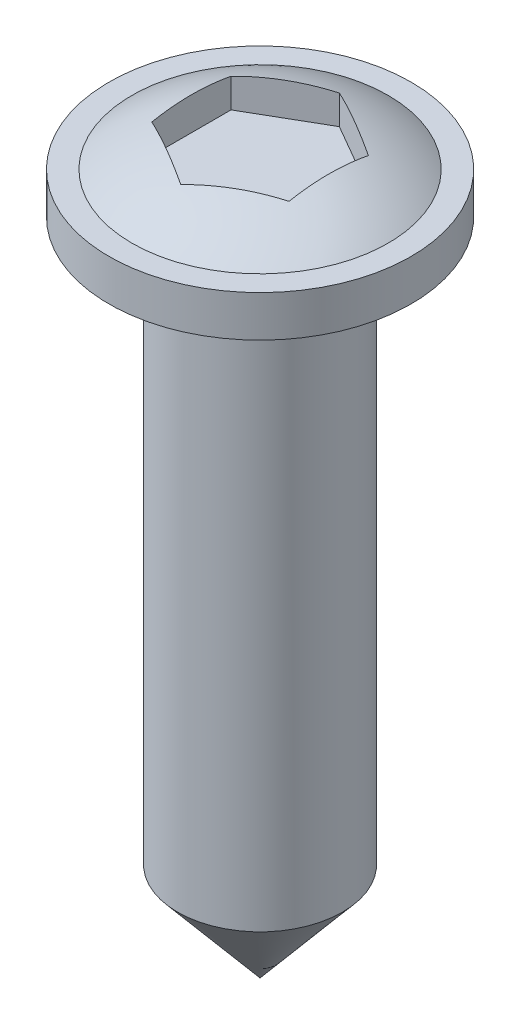
ISO-10303-21;
HEADER;
FILE_DESCRIPTION(('STEP AP214'),'2;1');
FILE_NAME('part.step','',(''),(''),'','','');
FILE_SCHEMA(('AUTOMOTIVE_DESIGN { 1 0 10303 214 1 1 1 1 }'));
ENDSEC;
DATA;
#1=APPLICATION_CONTEXT('core data for automotive mechanical design processes');
#2=APPLICATION_PROTOCOL_DEFINITION('international standard','automotive_design',2000,#1);
#3=PRODUCT_CONTEXT('',#1,'mechanical');
#4=PRODUCT('Part','Part','',(#3));
#5=PRODUCT_RELATED_PRODUCT_CATEGORY('part','',(#4));
#6=PRODUCT_DEFINITION_FORMATION('','',#4);
#7=PRODUCT_DEFINITION_CONTEXT('part definition',#1,'design');
#8=PRODUCT_DEFINITION('design','',#6,#7);
#9=PRODUCT_DEFINITION_SHAPE('','',#8);
#10=(LENGTH_UNIT() NAMED_UNIT(*) SI_UNIT(.MILLI.,.METRE.));
#11=(NAMED_UNIT(*) PLANE_ANGLE_UNIT() SI_UNIT($,.RADIAN.));
#12=(NAMED_UNIT(*) SI_UNIT($,.STERADIAN.) SOLID_ANGLE_UNIT());
#13=UNCERTAINTY_MEASURE_WITH_UNIT(LENGTH_MEASURE(1.E-05),#10,'distance_accuracy_value','');
#14=(GEOMETRIC_REPRESENTATION_CONTEXT(3) GLOBAL_UNCERTAINTY_ASSIGNED_CONTEXT((#13)) GLOBAL_UNIT_ASSIGNED_CONTEXT((#10,
#11,#12)) REPRESENTATION_CONTEXT('',''));
#15=CARTESIAN_POINT('',(0.,0.,0.));
#16=DIRECTION('',(0.,0.,1.));
#17=DIRECTION('',(1.,0.,0.));
#18=AXIS2_PLACEMENT_3D('',#15,#16,#17);
#19=CARTESIAN_POINT('',(0.,-18.8484126984127,0.));
#20=DIRECTION('',(0.,-1.,0.));
#21=DIRECTION('',(0.,0.,-1.));
#22=AXIS2_PLACEMENT_3D('',#19,#20,#21);
#23=CYLINDRICAL_SURFACE('',#22,2.75);
#24=CARTESIAN_POINT('',(0.,-1.5,0.));
#25=DIRECTION('',(0.,-1.,0.));
#26=DIRECTION('',(0.,0.,-1.));
#27=AXIS2_PLACEMENT_3D('',#24,#25,#26);
#28=CIRCLE('',#27,2.75);
#29=CARTESIAN_POINT('',(0.,-1.5,-2.75));
#30=VERTEX_POINT('',#29);
#31=EDGE_CURVE('E131',#30,#30,#28,.T.);
#32=ORIENTED_EDGE('',*,*,#31,.F.);
#33=EDGE_LOOP('',(#32));
#34=FACE_BOUND('',#33,.T.);
#35=CARTESIAN_POINT('',(0.,-0.750000000000028,0.));
#36=DIRECTION('',(0.,-1.,0.));
#37=DIRECTION('',(0.,0.,-1.));
#38=AXIS2_PLACEMENT_3D('',#35,#36,#37);
#39=CIRCLE('',#38,2.75);
#40=CARTESIAN_POINT('',(0.,-0.750000000000028,-2.75));
#41=VERTEX_POINT('',#40);
#42=EDGE_CURVE('E109',#41,#41,#39,.T.);
#43=ORIENTED_EDGE('',*,*,#42,.T.);
#44=EDGE_LOOP('',(#43));
#45=FACE_BOUND('',#44,.T.);
#46=ADVANCED_FACE('F26',(#34,#45),#23,.T.);
#47=CARTESIAN_POINT('',(-2.75,-1.5,0.));
#48=DIRECTION('',(0.,1.,0.));
#49=DIRECTION('',(0.,0.,1.));
#50=AXIS2_PLACEMENT_3D('',#47,#48,#49);
#51=PLANE('',#50);
#52=CARTESIAN_POINT('',(0.,-1.5,0.));
#53=DIRECTION('',(0.,-1.,0.));
#54=DIRECTION('',(0.,0.,-1.));
#55=AXIS2_PLACEMENT_3D('',#52,#53,#54);
#56=CIRCLE('',#55,1.5);
#57=CARTESIAN_POINT('',(0.,-1.5,-1.5));
#58=VERTEX_POINT('',#57);
#59=EDGE_CURVE('E128',#58,#58,#56,.T.);
#60=ORIENTED_EDGE('',*,*,#59,.F.);
#61=EDGE_LOOP('',(#60));
#62=FACE_BOUND('',#61,.T.);
#63=ORIENTED_EDGE('',*,*,#31,.T.);
#64=EDGE_LOOP('',(#63));
#65=FACE_BOUND('',#64,.T.);
#66=ADVANCED_FACE('F167',(#62,#65),#51,.F.);
#67=CARTESIAN_POINT('',(0.,-18.8484126984127,0.));
#68=DIRECTION('',(0.,-1.,0.));
#69=DIRECTION('',(0.,0.,-1.));
#70=AXIS2_PLACEMENT_3D('',#67,#68,#69);
#71=CYLINDRICAL_SURFACE('',#70,1.5);
#72=CARTESIAN_POINT('',(0.,-11.7123696111087,0.));
#73=DIRECTION('',(0.,-1.,0.));
#74=DIRECTION('',(0.,0.,-1.));
#75=AXIS2_PLACEMENT_3D('',#72,#73,#74);
#76=CIRCLE('',#75,1.5);
#77=CARTESIAN_POINT('',(0.,-11.7123696111087,-1.5));
#78=VERTEX_POINT('',#77);
#79=EDGE_CURVE('E125',#78,#78,#76,.T.);
#80=ORIENTED_EDGE('',*,*,#79,.F.);
#81=EDGE_LOOP('',(#80));
#82=FACE_BOUND('',#81,.T.);
#83=ORIENTED_EDGE('',*,*,#59,.T.);
#84=EDGE_LOOP('',(#83));
#85=FACE_BOUND('',#84,.T.);
#86=ADVANCED_FACE('F172',(#82,#85),#71,.T.);
#87=CARTESIAN_POINT('',(0.,-11.7123696111087,0.));
#88=DIRECTION('',(0.,1.,0.));
#89=DIRECTION('',(0.,0.,1.));
#90=AXIS2_PLACEMENT_3D('',#87,#88,#89);
#91=CONICAL_SURFACE('',#90,1.5,0.698131700797726);
#92=CARTESIAN_POINT('',(0.,-13.5,0.));
#93=VERTEX_POINT('',#92);
#94=VERTEX_LOOP('',#93);
#95=FACE_BOUND('',#94,.T.);
#96=ORIENTED_EDGE('',*,*,#79,.T.);
#97=EDGE_LOOP('',(#96));
#98=FACE_BOUND('',#97,.T.);
#99=ADVANCED_FACE('F184',(#95,#98),#91,.T.);
#100=CARTESIAN_POINT('',(0.,-4.,0.));
#101=DIRECTION('',(0.,-1.,0.));
#102=DIRECTION('',(-1.,0.,0.));
#103=AXIS2_PLACEMENT_3D('',#100,#101,#102);
#104=SPHERICAL_SURFACE('',#103,4.);
#105=CARTESIAN_POINT('',(-0.625000000000001,-4.,-1.08253175473055));
#106=DIRECTION('',(-0.5,0.,-0.866025403784439));
#107=DIRECTION('',(-0.866025403784439,0.,0.5));
#108=AXIS2_PLACEMENT_3D('',#105,#106,#107);
#109=CIRCLE('',#108,3.79967103839267);
#110=CARTESIAN_POINT('',(-1.25,-0.269495119066765,-0.721687836487031));
#111=VERTEX_POINT('',#110);
#112=CARTESIAN_POINT('',(0.,-0.269495119066765,-1.44337567297407));
#113=VERTEX_POINT('',#112);
#114=EDGE_CURVE('E134',#111,#113,#109,.T.);
#115=ORIENTED_EDGE('',*,*,#114,.T.);
#116=CARTESIAN_POINT('',(0.625000000000001,-4.,-1.08253175473055));
#117=DIRECTION('',(0.5,0.,-0.866025403784438));
#118=DIRECTION('',(-0.866025403784439,0.,-0.5));
#119=AXIS2_PLACEMENT_3D('',#116,#117,#118);
#120=CIRCLE('',#119,3.79967103839267);
#121=CARTESIAN_POINT('',(1.25,-0.269495119066765,-0.721687836487031));
#122=VERTEX_POINT('',#121);
#123=EDGE_CURVE('E11',#113,#122,#120,.T.);
#124=ORIENTED_EDGE('',*,*,#123,.T.);
#125=CARTESIAN_POINT('',(1.25,-4.,0.));
#126=DIRECTION('',(1.,0.,0.));
#127=DIRECTION('',(0.,0.,-1.));
#128=AXIS2_PLACEMENT_3D('',#125,#126,#127);
#129=CIRCLE('',#128,3.79967103839267);
#130=CARTESIAN_POINT('',(1.25,-0.269495119066765,0.721687836487031));
#131=VERTEX_POINT('',#130);
#132=EDGE_CURVE('E33',#122,#131,#129,.T.);
#133=ORIENTED_EDGE('',*,*,#132,.T.);
#134=CARTESIAN_POINT('',(0.625000000000001,-4.,1.08253175473055));
#135=DIRECTION('',(0.5,0.,0.866025403784439));
#136=DIRECTION('',(0.866025403784439,0.,-0.5));
#137=AXIS2_PLACEMENT_3D('',#134,#135,#136);
#138=CIRCLE('',#137,3.79967103839267);
#139=CARTESIAN_POINT('',(0.,-0.269495119066765,1.44337567297407));
#140=VERTEX_POINT('',#139);
#141=EDGE_CURVE('E142',#131,#140,#138,.T.);
#142=ORIENTED_EDGE('',*,*,#141,.T.);
#143=CARTESIAN_POINT('',(-0.625000000000001,-4.,1.08253175473055));
#144=DIRECTION('',(-0.5,0.,0.866025403784439));
#145=DIRECTION('',(0.866025403784439,0.,0.5));
#146=AXIS2_PLACEMENT_3D('',#143,#144,#145);
#147=CIRCLE('',#146,3.79967103839267);
#148=CARTESIAN_POINT('',(-1.25,-0.269495119066765,0.721687836487031));
#149=VERTEX_POINT('',#148);
#150=EDGE_CURVE('E139',#140,#149,#147,.T.);
#151=ORIENTED_EDGE('',*,*,#150,.T.);
#152=CARTESIAN_POINT('',(-1.25,-4.,0.));
#153=DIRECTION('',(-1.,0.,0.));
#154=DIRECTION('',(0.,0.,1.));
#155=AXIS2_PLACEMENT_3D('',#152,#153,#154);
#156=CIRCLE('',#155,3.79967103839267);
#157=EDGE_CURVE('E136',#149,#111,#156,.T.);
#158=ORIENTED_EDGE('',*,*,#157,.T.);
#159=EDGE_LOOP('',(#115,#124,#133,#142,#151,#158));
#160=FACE_BOUND('',#159,.T.);
#161=CARTESIAN_POINT('',(0.,-0.750000000000028,0.));
#162=DIRECTION('',(0.,-1.,0.));
#163=DIRECTION('',(0.,0.,-1.));
#164=AXIS2_PLACEMENT_3D('',#161,#162,#163);
#165=CIRCLE('',#164,2.3318447632722);
#166=CARTESIAN_POINT('',(0.,-0.750000000000028,-2.3318447632722));
#167=VERTEX_POINT('',#166);
#168=EDGE_CURVE('E122',#167,#167,#165,.T.);
#169=ORIENTED_EDGE('',*,*,#168,.F.);
#170=EDGE_LOOP('',(#169));
#171=FACE_BOUND('',#170,.T.);
#172=ADVANCED_FACE('F146',(#160,#171),#104,.T.);
#173=CARTESIAN_POINT('',(-2.75,-0.749999999999973,0.));
#174=DIRECTION('',(0.,-1.,0.));
#175=DIRECTION('',(0.,0.,-1.));
#176=AXIS2_PLACEMENT_3D('',#173,#174,#175);
#177=PLANE('',#176);
#178=ORIENTED_EDGE('',*,*,#42,.F.);
#179=EDGE_LOOP('',(#178));
#180=FACE_BOUND('',#179,.T.);
#181=ORIENTED_EDGE('',*,*,#168,.T.);
#182=EDGE_LOOP('',(#181));
#183=FACE_BOUND('',#182,.T.);
#184=ADVANCED_FACE('F178',(#180,#183),#177,.F.);
#185=CARTESIAN_POINT('',(1.25,-0.800000000000023,-0.721687836487031));
#186=DIRECTION('',(0.5,0.,-0.866025403784438));
#187=DIRECTION('',(-0.866025403784439,0.,-0.5));
#188=AXIS2_PLACEMENT_3D('',#185,#186,#187);
#189=PLANE('',#188);
#190=DIRECTION('',(0.,1.,0.));
#191=VECTOR('',#190,1.);
#192=CARTESIAN_POINT('',(0.,-0.800000000000023,-1.44337567297407));
#193=LINE('',#192,#191);
#194=CARTESIAN_POINT('',(0.,-0.800000000000023,-1.44337567297407));
#195=VERTEX_POINT('',#194);
#196=EDGE_CURVE('E40',#195,#113,#193,.T.);
#197=ORIENTED_EDGE('',*,*,#196,.F.);
#198=DIRECTION('',(-0.866025403784438,0.,-0.5));
#199=VECTOR('',#198,1.);
#200=CARTESIAN_POINT('',(1.25,-0.800000000000023,-0.721687836487031));
#201=LINE('',#200,#199);
#202=CARTESIAN_POINT('',(1.25,-0.800000000000023,-0.721687836487031));
#203=VERTEX_POINT('',#202);
#204=EDGE_CURVE('E80',#203,#195,#201,.T.);
#205=ORIENTED_EDGE('',*,*,#204,.F.);
#206=DIRECTION('',(0.,1.,0.));
#207=VECTOR('',#206,1.);
#208=CARTESIAN_POINT('',(1.25,-0.800000000000023,-0.721687836487031));
#209=LINE('',#208,#207);
#210=EDGE_CURVE('E107',#203,#122,#209,.T.);
#211=ORIENTED_EDGE('',*,*,#210,.T.);
#212=ORIENTED_EDGE('',*,*,#123,.F.);
#213=EDGE_LOOP('',(#197,#205,#211,#212));
#214=FACE_BOUND('',#213,.T.);
#215=ADVANCED_FACE('F77',(#214),#189,.F.);
#216=CARTESIAN_POINT('',(1.25,-0.800000000000023,0.721687836487031));
#217=DIRECTION('',(1.,0.,0.));
#218=DIRECTION('',(0.,0.,-1.));
#219=AXIS2_PLACEMENT_3D('',#216,#217,#218);
#220=PLANE('',#219);
#221=ORIENTED_EDGE('',*,*,#210,.F.);
#222=DIRECTION('',(0.,0.,-1.));
#223=VECTOR('',#222,1.);
#224=CARTESIAN_POINT('',(1.25,-0.800000000000023,0.721687836487031));
#225=LINE('',#224,#223);
#226=CARTESIAN_POINT('',(1.25,-0.800000000000023,0.721687836487031));
#227=VERTEX_POINT('',#226);
#228=EDGE_CURVE('E84',#227,#203,#225,.T.);
#229=ORIENTED_EDGE('',*,*,#228,.F.);
#230=DIRECTION('',(0.,1.,0.));
#231=VECTOR('',#230,1.);
#232=CARTESIAN_POINT('',(1.25,-0.800000000000023,0.721687836487031));
#233=LINE('',#232,#231);
#234=EDGE_CURVE('E110',#227,#131,#233,.T.);
#235=ORIENTED_EDGE('',*,*,#234,.T.);
#236=ORIENTED_EDGE('',*,*,#132,.F.);
#237=EDGE_LOOP('',(#221,#229,#235,#236));
#238=FACE_BOUND('',#237,.T.);
#239=ADVANCED_FACE('F149',(#238),#220,.F.);
#240=CARTESIAN_POINT('',(0.,-0.800000000000023,1.44337567297407));
#241=DIRECTION('',(0.5,0.,0.866025403784439));
#242=DIRECTION('',(0.866025403784439,0.,-0.5));
#243=AXIS2_PLACEMENT_3D('',#240,#241,#242);
#244=PLANE('',#243);
#245=ORIENTED_EDGE('',*,*,#234,.F.);
#246=DIRECTION('',(0.866025403784439,0.,-0.5));
#247=VECTOR('',#246,1.);
#248=CARTESIAN_POINT('',(0.,-0.800000000000023,1.44337567297407));
#249=LINE('',#248,#247);
#250=CARTESIAN_POINT('',(0.,-0.800000000000023,1.44337567297407));
#251=VERTEX_POINT('',#250);
#252=EDGE_CURVE('E104',#251,#227,#249,.T.);
#253=ORIENTED_EDGE('',*,*,#252,.F.);
#254=DIRECTION('',(0.,1.,0.));
#255=VECTOR('',#254,1.);
#256=CARTESIAN_POINT('',(0.,-0.800000000000023,1.44337567297407));
#257=LINE('',#256,#255);
#258=EDGE_CURVE('E113',#251,#140,#257,.T.);
#259=ORIENTED_EDGE('',*,*,#258,.T.);
#260=ORIENTED_EDGE('',*,*,#141,.F.);
#261=EDGE_LOOP('',(#245,#253,#259,#260));
#262=FACE_BOUND('',#261,.T.);
#263=ADVANCED_FACE('F152',(#262),#244,.F.);
#264=CARTESIAN_POINT('',(-1.25,-0.800000000000023,0.721687836487031));
#265=DIRECTION('',(-0.5,0.,0.866025403784439));
#266=DIRECTION('',(0.866025403784439,0.,0.5));
#267=AXIS2_PLACEMENT_3D('',#264,#265,#266);
#268=PLANE('',#267);
#269=ORIENTED_EDGE('',*,*,#258,.F.);
#270=DIRECTION('',(0.866025403784439,0.,0.5));
#271=VECTOR('',#270,1.);
#272=CARTESIAN_POINT('',(-1.25,-0.800000000000023,0.721687836487031));
#273=LINE('',#272,#271);
#274=CARTESIAN_POINT('',(-1.25,-0.800000000000023,0.721687836487031));
#275=VERTEX_POINT('',#274);
#276=EDGE_CURVE('E101',#275,#251,#273,.T.);
#277=ORIENTED_EDGE('',*,*,#276,.F.);
#278=DIRECTION('',(0.,1.,0.));
#279=VECTOR('',#278,1.);
#280=CARTESIAN_POINT('',(-1.25,-0.800000000000023,0.721687836487031));
#281=LINE('',#280,#279);
#282=EDGE_CURVE('E116',#275,#149,#281,.T.);
#283=ORIENTED_EDGE('',*,*,#282,.T.);
#284=ORIENTED_EDGE('',*,*,#150,.F.);
#285=EDGE_LOOP('',(#269,#277,#283,#284));
#286=FACE_BOUND('',#285,.T.);
#287=ADVANCED_FACE('F155',(#286),#268,.F.);
#288=CARTESIAN_POINT('',(-1.25,-0.800000000000023,-0.721687836487031));
#289=DIRECTION('',(-1.,0.,0.));
#290=DIRECTION('',(0.,0.,1.));
#291=AXIS2_PLACEMENT_3D('',#288,#289,#290);
#292=PLANE('',#291);
#293=ORIENTED_EDGE('',*,*,#282,.F.);
#294=DIRECTION('',(0.,0.,1.));
#295=VECTOR('',#294,1.);
#296=CARTESIAN_POINT('',(-1.25,-0.800000000000023,-0.721687836487031));
#297=LINE('',#296,#295);
#298=CARTESIAN_POINT('',(-1.25,-0.800000000000023,-0.721687836487031));
#299=VERTEX_POINT('',#298);
#300=EDGE_CURVE('E93',#299,#275,#297,.T.);
#301=ORIENTED_EDGE('',*,*,#300,.F.);
#302=DIRECTION('',(0.,1.,0.));
#303=VECTOR('',#302,1.);
#304=CARTESIAN_POINT('',(-1.25,-0.800000000000023,-0.721687836487031));
#305=LINE('',#304,#303);
#306=EDGE_CURVE('E83',#299,#111,#305,.T.);
#307=ORIENTED_EDGE('',*,*,#306,.T.);
#308=ORIENTED_EDGE('',*,*,#157,.F.);
#309=EDGE_LOOP('',(#293,#301,#307,#308));
#310=FACE_BOUND('',#309,.T.);
#311=ADVANCED_FACE('F157',(#310),#292,.F.);
#312=CARTESIAN_POINT('',(0.,-0.800000000000023,-1.44337567297407));
#313=DIRECTION('',(-0.5,0.,-0.866025403784439));
#314=DIRECTION('',(-0.866025403784439,0.,0.5));
#315=AXIS2_PLACEMENT_3D('',#312,#313,#314);
#316=PLANE('',#315);
#317=ORIENTED_EDGE('',*,*,#306,.F.);
#318=DIRECTION('',(-0.866025403784439,0.,0.5));
#319=VECTOR('',#318,1.);
#320=CARTESIAN_POINT('',(0.,-0.800000000000023,-1.44337567297407));
#321=LINE('',#320,#319);
#322=EDGE_CURVE('E87',#195,#299,#321,.T.);
#323=ORIENTED_EDGE('',*,*,#322,.F.);
#324=ORIENTED_EDGE('',*,*,#196,.T.);
#325=ORIENTED_EDGE('',*,*,#114,.F.);
#326=EDGE_LOOP('',(#317,#323,#324,#325));
#327=FACE_BOUND('',#326,.T.);
#328=ADVANCED_FACE('F88',(#327),#316,.F.);
#329=CARTESIAN_POINT('',(0.,-0.800000000000023,-1.44337567297407));
#330=DIRECTION('',(0.,1.,0.));
#331=DIRECTION('',(0.,0.,1.));
#332=AXIS2_PLACEMENT_3D('',#329,#330,#331);
#333=PLANE('',#332);
#334=ORIENTED_EDGE('',*,*,#204,.T.);
#335=ORIENTED_EDGE('',*,*,#322,.T.);
#336=ORIENTED_EDGE('',*,*,#300,.T.);
#337=ORIENTED_EDGE('',*,*,#276,.T.);
#338=ORIENTED_EDGE('',*,*,#252,.T.);
#339=ORIENTED_EDGE('',*,*,#228,.T.);
#340=EDGE_LOOP('',(#334,#335,#336,#337,#338,#339));
#341=FACE_BOUND('',#340,.T.);
#342=ADVANCED_FACE('F95',(#341),#333,.T.);
#343=CLOSED_SHELL('',(#46,#66,#86,#99,#172,#184,#215,#239,#263,#287,#311,#328,#342));
#344=MANIFOLD_SOLID_BREP('B2',#343);
#345=ADVANCED_BREP_SHAPE_REPRESENTATION('',(#18,#344),#14);
#346=SHAPE_DEFINITION_REPRESENTATION(#9,#345);
ENDSEC;
END-ISO-10303-21;
